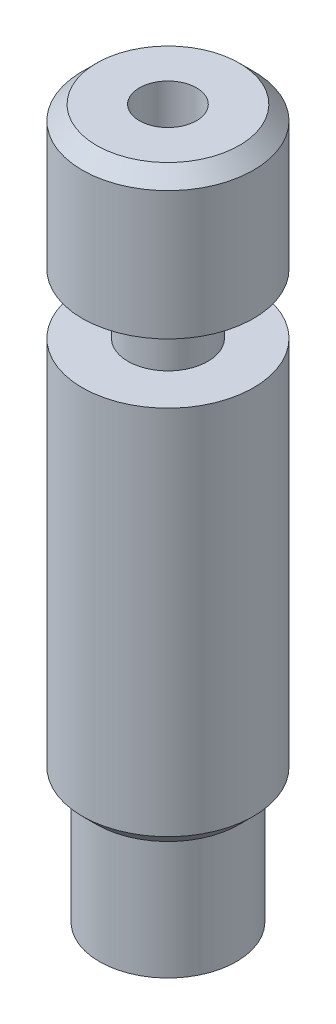
ISO-10303-21;
HEADER;
FILE_DESCRIPTION(('STEP AP214'),'2;1');
FILE_NAME('part.step','',(''),(''),'','','');
FILE_SCHEMA(('AUTOMOTIVE_DESIGN { 1 0 10303 214 1 1 1 1 }'));
ENDSEC;
DATA;
#1=APPLICATION_CONTEXT('core data for automotive mechanical design processes');
#2=APPLICATION_PROTOCOL_DEFINITION('international standard','automotive_design',2000,#1);
#3=PRODUCT_CONTEXT('',#1,'mechanical');
#4=PRODUCT('Part','Part','',(#3));
#5=PRODUCT_RELATED_PRODUCT_CATEGORY('part','',(#4));
#6=PRODUCT_DEFINITION_FORMATION('','',#4);
#7=PRODUCT_DEFINITION_CONTEXT('part definition',#1,'design');
#8=PRODUCT_DEFINITION('design','',#6,#7);
#9=PRODUCT_DEFINITION_SHAPE('','',#8);
#10=(LENGTH_UNIT() NAMED_UNIT(*) SI_UNIT(.MILLI.,.METRE.));
#11=(NAMED_UNIT(*) PLANE_ANGLE_UNIT() SI_UNIT($,.RADIAN.));
#12=(NAMED_UNIT(*) SI_UNIT($,.STERADIAN.) SOLID_ANGLE_UNIT());
#13=UNCERTAINTY_MEASURE_WITH_UNIT(LENGTH_MEASURE(1.E-05),#10,'distance_accuracy_value','');
#14=(GEOMETRIC_REPRESENTATION_CONTEXT(3) GLOBAL_UNCERTAINTY_ASSIGNED_CONTEXT((#13)) GLOBAL_UNIT_ASSIGNED_CONTEXT((#10,
#11,#12)) REPRESENTATION_CONTEXT('',''));
#15=CARTESIAN_POINT('',(0.,0.,0.));
#16=DIRECTION('',(0.,0.,1.));
#17=DIRECTION('',(1.,0.,0.));
#18=AXIS2_PLACEMENT_3D('',#15,#16,#17);
#19=CARTESIAN_POINT('',(1.,12.55,0.));
#20=DIRECTION('',(0.,-1.,0.));
#21=DIRECTION('',(0.,0.,-1.));
#22=AXIS2_PLACEMENT_3D('',#19,#20,#21);
#23=PLANE('',#22);
#24=CARTESIAN_POINT('',(0.,12.55,0.));
#25=DIRECTION('',(0.,1.,0.));
#26=DIRECTION('',(0.,0.,1.));
#27=AXIS2_PLACEMENT_3D('',#24,#25,#26);
#28=CIRCLE('',#27,0.999999999999997);
#29=CARTESIAN_POINT('',(0.,12.55,0.999999999999997));
#30=VERTEX_POINT('',#29);
#31=EDGE_CURVE('E77',#30,#30,#28,.T.);
#32=ORIENTED_EDGE('',*,*,#31,.F.);
#33=EDGE_LOOP('',(#32));
#34=FACE_BOUND('',#33,.T.);
#35=CARTESIAN_POINT('',(0.,12.55,0.));
#36=DIRECTION('',(0.,1.,0.));
#37=DIRECTION('',(0.,0.,1.));
#38=AXIS2_PLACEMENT_3D('',#35,#36,#37);
#39=CIRCLE('',#38,2.49999999999999);
#40=CARTESIAN_POINT('',(0.,12.55,2.49999999999999));
#41=VERTEX_POINT('',#40);
#42=EDGE_CURVE('E10',#41,#41,#39,.T.);
#43=ORIENTED_EDGE('',*,*,#42,.T.);
#44=EDGE_LOOP('',(#43));
#45=FACE_BOUND('',#44,.T.);
#46=ADVANCED_FACE('F31',(#34,#45),#23,.F.);
#47=CARTESIAN_POINT('',(0.,12.05,0.));
#48=DIRECTION('',(0.,-1.,0.));
#49=DIRECTION('',(0.,0.,-1.));
#50=AXIS2_PLACEMENT_3D('',#47,#48,#49);
#51=CONICAL_SURFACE('',#50,2.99999999999999,0.785398163397448);
#52=ORIENTED_EDGE('',*,*,#42,.F.);
#53=EDGE_LOOP('',(#52));
#54=FACE_BOUND('',#53,.T.);
#55=CARTESIAN_POINT('',(0.,12.05,0.));
#56=DIRECTION('',(0.,1.,0.));
#57=DIRECTION('',(0.,0.,1.));
#58=AXIS2_PLACEMENT_3D('',#55,#56,#57);
#59=CIRCLE('',#58,2.99999999999999);
#60=CARTESIAN_POINT('',(0.,12.05,2.99999999999999));
#61=VERTEX_POINT('',#60);
#62=EDGE_CURVE('E37',#61,#61,#59,.T.);
#63=ORIENTED_EDGE('',*,*,#62,.T.);
#64=EDGE_LOOP('',(#63));
#65=FACE_BOUND('',#64,.T.);
#66=ADVANCED_FACE('F84',(#54,#65),#51,.T.);
#67=CARTESIAN_POINT('',(0.,12.55,0.));
#68=DIRECTION('',(0.,1.,0.));
#69=DIRECTION('',(0.,0.,1.));
#70=AXIS2_PLACEMENT_3D('',#67,#68,#69);
#71=CYLINDRICAL_SURFACE('',#70,2.99999999999999);
#72=ORIENTED_EDGE('',*,*,#62,.F.);
#73=EDGE_LOOP('',(#72));
#74=FACE_BOUND('',#73,.T.);
#75=CARTESIAN_POINT('',(0.,7.55,0.));
#76=DIRECTION('',(0.,1.,0.));
#77=DIRECTION('',(0.,0.,1.));
#78=AXIS2_PLACEMENT_3D('',#75,#76,#77);
#79=CIRCLE('',#78,2.99999999999999);
#80=CARTESIAN_POINT('',(0.,7.55,2.99999999999999));
#81=VERTEX_POINT('',#80);
#82=EDGE_CURVE('E41',#81,#81,#79,.T.);
#83=ORIENTED_EDGE('',*,*,#82,.T.);
#84=EDGE_LOOP('',(#83));
#85=FACE_BOUND('',#84,.T.);
#86=ADVANCED_FACE('F88',(#74,#85),#71,.T.);
#87=CARTESIAN_POINT('',(3.,7.55,0.));
#88=DIRECTION('',(0.,1.,0.));
#89=DIRECTION('',(0.,0.,1.));
#90=AXIS2_PLACEMENT_3D('',#87,#88,#89);
#91=PLANE('',#90);
#92=ORIENTED_EDGE('',*,*,#82,.F.);
#93=EDGE_LOOP('',(#92));
#94=FACE_BOUND('',#93,.T.);
#95=CARTESIAN_POINT('',(0.,7.55,0.));
#96=DIRECTION('',(0.,1.,0.));
#97=DIRECTION('',(0.,0.,1.));
#98=AXIS2_PLACEMENT_3D('',#95,#96,#97);
#99=CIRCLE('',#98,1.4);
#100=CARTESIAN_POINT('',(0.,7.55,1.4));
#101=VERTEX_POINT('',#100);
#102=EDGE_CURVE('E45',#101,#101,#99,.T.);
#103=ORIENTED_EDGE('',*,*,#102,.T.);
#104=EDGE_LOOP('',(#103));
#105=FACE_BOUND('',#104,.T.);
#106=ADVANCED_FACE('F93',(#94,#105),#91,.F.);
#107=CARTESIAN_POINT('',(0.,12.55,0.));
#108=DIRECTION('',(0.,1.,0.));
#109=DIRECTION('',(0.,0.,1.));
#110=AXIS2_PLACEMENT_3D('',#107,#108,#109);
#111=CYLINDRICAL_SURFACE('',#110,1.4);
#112=ORIENTED_EDGE('',*,*,#102,.F.);
#113=EDGE_LOOP('',(#112));
#114=FACE_BOUND('',#113,.T.);
#115=CARTESIAN_POINT('',(0.,5.45,0.));
#116=DIRECTION('',(0.,1.,0.));
#117=DIRECTION('',(0.,0.,1.));
#118=AXIS2_PLACEMENT_3D('',#115,#116,#117);
#119=CIRCLE('',#118,1.4);
#120=CARTESIAN_POINT('',(0.,5.45,1.4));
#121=VERTEX_POINT('',#120);
#122=EDGE_CURVE('E50',#121,#121,#119,.T.);
#123=ORIENTED_EDGE('',*,*,#122,.T.);
#124=EDGE_LOOP('',(#123));
#125=FACE_BOUND('',#124,.T.);
#126=ADVANCED_FACE('F99',(#114,#125),#111,.T.);
#127=CARTESIAN_POINT('',(1.4,5.45,0.));
#128=DIRECTION('',(0.,-1.,0.));
#129=DIRECTION('',(0.,0.,-1.));
#130=AXIS2_PLACEMENT_3D('',#127,#128,#129);
#131=PLANE('',#130);
#132=ORIENTED_EDGE('',*,*,#122,.F.);
#133=EDGE_LOOP('',(#132));
#134=FACE_BOUND('',#133,.T.);
#135=CARTESIAN_POINT('',(0.,5.45,0.));
#136=DIRECTION('',(0.,1.,0.));
#137=DIRECTION('',(0.,0.,1.));
#138=AXIS2_PLACEMENT_3D('',#135,#136,#137);
#139=CIRCLE('',#138,3.);
#140=CARTESIAN_POINT('',(0.,5.45,3.));
#141=VERTEX_POINT('',#140);
#142=EDGE_CURVE('E53',#141,#141,#139,.T.);
#143=ORIENTED_EDGE('',*,*,#142,.T.);
#144=EDGE_LOOP('',(#143));
#145=FACE_BOUND('',#144,.T.);
#146=ADVANCED_FACE('F103',(#134,#145),#131,.F.);
#147=CARTESIAN_POINT('',(0.,12.55,0.));
#148=DIRECTION('',(0.,1.,0.));
#149=DIRECTION('',(0.,0.,1.));
#150=AXIS2_PLACEMENT_3D('',#147,#148,#149);
#151=CYLINDRICAL_SURFACE('',#150,3.);
#152=ORIENTED_EDGE('',*,*,#142,.F.);
#153=EDGE_LOOP('',(#152));
#154=FACE_BOUND('',#153,.T.);
#155=CARTESIAN_POINT('',(0.,-7.55,0.));
#156=DIRECTION('',(0.,1.,0.));
#157=DIRECTION('',(0.,0.,1.));
#158=AXIS2_PLACEMENT_3D('',#155,#156,#157);
#159=CIRCLE('',#158,3.);
#160=CARTESIAN_POINT('',(0.,-7.55,3.));
#161=VERTEX_POINT('',#160);
#162=EDGE_CURVE('E56',#161,#161,#159,.T.);
#163=ORIENTED_EDGE('',*,*,#162,.T.);
#164=EDGE_LOOP('',(#163));
#165=FACE_BOUND('',#164,.T.);
#166=ADVANCED_FACE('F107',(#154,#165),#151,.T.);
#167=CARTESIAN_POINT('',(0.,-8.05,0.));
#168=DIRECTION('',(0.,1.,0.));
#169=DIRECTION('',(0.,0.,1.));
#170=AXIS2_PLACEMENT_3D('',#167,#168,#169);
#171=CONICAL_SURFACE('',#170,2.5,0.785398163397448);
#172=ORIENTED_EDGE('',*,*,#162,.F.);
#173=EDGE_LOOP('',(#172));
#174=FACE_BOUND('',#173,.T.);
#175=CARTESIAN_POINT('',(0.,-8.05,0.));
#176=DIRECTION('',(0.,1.,0.));
#177=DIRECTION('',(0.,0.,1.));
#178=AXIS2_PLACEMENT_3D('',#175,#176,#177);
#179=CIRCLE('',#178,2.5);
#180=CARTESIAN_POINT('',(0.,-8.05,2.5));
#181=VERTEX_POINT('',#180);
#182=EDGE_CURVE('E59',#181,#181,#179,.T.);
#183=ORIENTED_EDGE('',*,*,#182,.T.);
#184=EDGE_LOOP('',(#183));
#185=FACE_BOUND('',#184,.T.);
#186=ADVANCED_FACE('F111',(#174,#185),#171,.T.);
#187=CARTESIAN_POINT('',(2.4,-8.05,0.));
#188=DIRECTION('',(0.,1.,0.));
#189=DIRECTION('',(0.,0.,1.));
#190=AXIS2_PLACEMENT_3D('',#187,#188,#189);
#191=PLANE('',#190);
#192=ORIENTED_EDGE('',*,*,#182,.F.);
#193=EDGE_LOOP('',(#192));
#194=FACE_BOUND('',#193,.T.);
#195=CARTESIAN_POINT('',(0.,-8.05,0.));
#196=DIRECTION('',(0.,1.,0.));
#197=DIRECTION('',(0.,0.,1.));
#198=AXIS2_PLACEMENT_3D('',#195,#196,#197);
#199=CIRCLE('',#198,2.4);
#200=CARTESIAN_POINT('',(0.,-8.05,2.4));
#201=VERTEX_POINT('',#200);
#202=EDGE_CURVE('E62',#201,#201,#199,.T.);
#203=ORIENTED_EDGE('',*,*,#202,.T.);
#204=EDGE_LOOP('',(#203));
#205=FACE_BOUND('',#204,.T.);
#206=ADVANCED_FACE('F115',(#194,#205),#191,.F.);
#207=CARTESIAN_POINT('',(0.,12.55,0.));
#208=DIRECTION('',(0.,1.,0.));
#209=DIRECTION('',(0.,0.,1.));
#210=AXIS2_PLACEMENT_3D('',#207,#208,#209);
#211=CYLINDRICAL_SURFACE('',#210,2.4);
#212=ORIENTED_EDGE('',*,*,#202,.F.);
#213=EDGE_LOOP('',(#212));
#214=FACE_BOUND('',#213,.T.);
#215=CARTESIAN_POINT('',(0.,-12.2613248654052,0.));
#216=DIRECTION('',(0.,1.,0.));
#217=DIRECTION('',(0.,0.,1.));
#218=AXIS2_PLACEMENT_3D('',#215,#216,#217);
#219=CIRCLE('',#218,2.4);
#220=CARTESIAN_POINT('',(0.,-12.2613248654052,2.4));
#221=VERTEX_POINT('',#220);
#222=EDGE_CURVE('E65',#221,#221,#219,.T.);
#223=ORIENTED_EDGE('',*,*,#222,.T.);
#224=EDGE_LOOP('',(#223));
#225=FACE_BOUND('',#224,.T.);
#226=ADVANCED_FACE('F119',(#214,#225),#211,.T.);
#227=CARTESIAN_POINT('',(0.,-12.55,0.));
#228=DIRECTION('',(0.,1.,0.));
#229=DIRECTION('',(0.,0.,1.));
#230=AXIS2_PLACEMENT_3D('',#227,#228,#229);
#231=CONICAL_SURFACE('',#230,1.9,1.0471975511966);
#232=ORIENTED_EDGE('',*,*,#222,.F.);
#233=EDGE_LOOP('',(#232));
#234=FACE_BOUND('',#233,.T.);
#235=CARTESIAN_POINT('',(0.,-12.55,0.));
#236=DIRECTION('',(0.,1.,0.));
#237=DIRECTION('',(0.,0.,1.));
#238=AXIS2_PLACEMENT_3D('',#235,#236,#237);
#239=CIRCLE('',#238,1.9);
#240=CARTESIAN_POINT('',(0.,-12.55,1.9));
#241=VERTEX_POINT('',#240);
#242=EDGE_CURVE('E68',#241,#241,#239,.T.);
#243=ORIENTED_EDGE('',*,*,#242,.T.);
#244=EDGE_LOOP('',(#243));
#245=FACE_BOUND('',#244,.T.);
#246=ADVANCED_FACE('F123',(#234,#245),#231,.T.);
#247=CARTESIAN_POINT('',(1.4,-12.55,0.));
#248=DIRECTION('',(0.,1.,0.));
#249=DIRECTION('',(0.,0.,1.));
#250=AXIS2_PLACEMENT_3D('',#247,#248,#249);
#251=PLANE('',#250);
#252=ORIENTED_EDGE('',*,*,#242,.F.);
#253=EDGE_LOOP('',(#252));
#254=FACE_BOUND('',#253,.T.);
#255=CARTESIAN_POINT('',(0.,-12.55,0.));
#256=DIRECTION('',(0.,1.,0.));
#257=DIRECTION('',(0.,0.,1.));
#258=AXIS2_PLACEMENT_3D('',#255,#256,#257);
#259=CIRCLE('',#258,1.4);
#260=CARTESIAN_POINT('',(0.,-12.55,1.4));
#261=VERTEX_POINT('',#260);
#262=EDGE_CURVE('E71',#261,#261,#259,.T.);
#263=ORIENTED_EDGE('',*,*,#262,.T.);
#264=EDGE_LOOP('',(#263));
#265=FACE_BOUND('',#264,.T.);
#266=ADVANCED_FACE('F127',(#254,#265),#251,.F.);
#267=CARTESIAN_POINT('',(0.,-12.15,0.));
#268=DIRECTION('',(0.,-1.,0.));
#269=DIRECTION('',(0.,0.,-1.));
#270=AXIS2_PLACEMENT_3D('',#267,#268,#269);
#271=CONICAL_SURFACE('',#270,0.999999999999997,0.785398163397451);
#272=ORIENTED_EDGE('',*,*,#262,.F.);
#273=EDGE_LOOP('',(#272));
#274=FACE_BOUND('',#273,.T.);
#275=CARTESIAN_POINT('',(0.,-12.15,0.));
#276=DIRECTION('',(0.,1.,0.));
#277=DIRECTION('',(0.,0.,1.));
#278=AXIS2_PLACEMENT_3D('',#275,#276,#277);
#279=CIRCLE('',#278,0.999999999999997);
#280=CARTESIAN_POINT('',(0.,-12.15,0.999999999999997));
#281=VERTEX_POINT('',#280);
#282=EDGE_CURVE('E74',#281,#281,#279,.T.);
#283=ORIENTED_EDGE('',*,*,#282,.T.);
#284=EDGE_LOOP('',(#283));
#285=FACE_BOUND('',#284,.T.);
#286=ADVANCED_FACE('F131',(#274,#285),#271,.F.);
#287=CARTESIAN_POINT('',(0.,12.55,0.));
#288=DIRECTION('',(0.,1.,0.));
#289=DIRECTION('',(0.,0.,1.));
#290=AXIS2_PLACEMENT_3D('',#287,#288,#289);
#291=CYLINDRICAL_SURFACE('',#290,0.999999999999997);
#292=ORIENTED_EDGE('',*,*,#282,.F.);
#293=EDGE_LOOP('',(#292));
#294=FACE_BOUND('',#293,.T.);
#295=ORIENTED_EDGE('',*,*,#31,.T.);
#296=EDGE_LOOP('',(#295));
#297=FACE_BOUND('',#296,.T.);
#298=ADVANCED_FACE('F81',(#294,#297),#291,.F.);
#299=CLOSED_SHELL('',(#46,#66,#86,#106,#126,#146,#166,#186,#206,#226,#246,#266,#286,#298));
#300=MANIFOLD_SOLID_BREP('B2',#299);
#301=ADVANCED_BREP_SHAPE_REPRESENTATION('',(#18,#300),#14);
#302=SHAPE_DEFINITION_REPRESENTATION(#9,#301);
ENDSEC;
END-ISO-10303-21;
